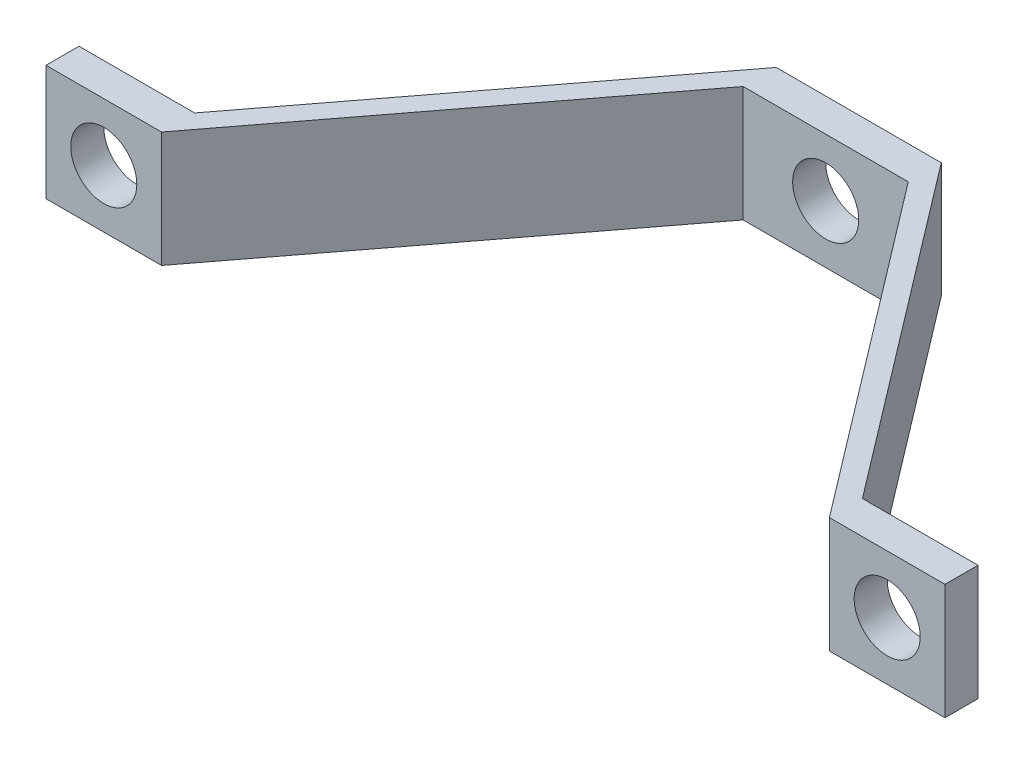
ISO-10303-21;
HEADER;
FILE_DESCRIPTION(('STEP AP214'),'2;1');
FILE_NAME('part.step','',(''),(''),'','','');
FILE_SCHEMA(('AUTOMOTIVE_DESIGN { 1 0 10303 214 1 1 1 1 }'));
ENDSEC;
DATA;
#1=APPLICATION_CONTEXT('core data for automotive mechanical design processes');
#2=APPLICATION_PROTOCOL_DEFINITION('international standard','automotive_design',2000,#1);
#3=PRODUCT_CONTEXT('',#1,'mechanical');
#4=PRODUCT('Part','Part','',(#3));
#5=PRODUCT_RELATED_PRODUCT_CATEGORY('part','',(#4));
#6=PRODUCT_DEFINITION_FORMATION('','',#4);
#7=PRODUCT_DEFINITION_CONTEXT('part definition',#1,'design');
#8=PRODUCT_DEFINITION('design','',#6,#7);
#9=PRODUCT_DEFINITION_SHAPE('','',#8);
#10=(LENGTH_UNIT() NAMED_UNIT(*) SI_UNIT(.MILLI.,.METRE.));
#11=(NAMED_UNIT(*) PLANE_ANGLE_UNIT() SI_UNIT($,.RADIAN.));
#12=(NAMED_UNIT(*) SI_UNIT($,.STERADIAN.) SOLID_ANGLE_UNIT());
#13=UNCERTAINTY_MEASURE_WITH_UNIT(LENGTH_MEASURE(1.E-05),#10,'distance_accuracy_value','');
#14=(GEOMETRIC_REPRESENTATION_CONTEXT(3) GLOBAL_UNCERTAINTY_ASSIGNED_CONTEXT((#13)) GLOBAL_UNIT_ASSIGNED_CONTEXT((#10,
#11,#12)) REPRESENTATION_CONTEXT('',''));
#15=CARTESIAN_POINT('',(0.,0.,0.));
#16=DIRECTION('',(0.,0.,1.));
#17=DIRECTION('',(1.,0.,0.));
#18=AXIS2_PLACEMENT_3D('',#15,#16,#17);
#19=CARTESIAN_POINT('',(34.57448,8.89,27.94));
#20=DIRECTION('',(0.,0.,-1.));
#21=DIRECTION('',(-1.,0.,0.));
#22=AXIS2_PLACEMENT_3D('',#19,#20,#21);
#23=PLANE('',#22);
#24=CARTESIAN_POINT('',(30.12948,4.445,27.94));
#25=DIRECTION('',(0.,0.,1.));
#26=DIRECTION('',(1.,0.,0.));
#27=AXIS2_PLACEMENT_3D('',#24,#25,#26);
#28=CIRCLE('',#27,2.54);
#29=CARTESIAN_POINT('',(32.66948,4.445,27.94));
#30=VERTEX_POINT('',#29);
#31=EDGE_CURVE('E265',#30,#30,#28,.T.);
#32=ORIENTED_EDGE('',*,*,#31,.F.);
#33=EDGE_LOOP('',(#32));
#34=FACE_BOUND('',#33,.T.);
#35=DIRECTION('',(1.,0.,0.));
#36=VECTOR('',#35,1.);
#37=CARTESIAN_POINT('',(34.57448,0.,27.94));
#38=LINE('',#37,#36);
#39=CARTESIAN_POINT('',(25.68448,0.,27.94));
#40=VERTEX_POINT('',#39);
#41=CARTESIAN_POINT('',(34.57448,0.,27.94));
#42=VERTEX_POINT('',#41);
#43=EDGE_CURVE('E155',#40,#42,#38,.T.);
#44=ORIENTED_EDGE('',*,*,#43,.T.);
#45=DIRECTION('',(0.,-1.,0.));
#46=VECTOR('',#45,1.);
#47=CARTESIAN_POINT('',(34.57448,8.89,27.94));
#48=LINE('',#47,#46);
#49=CARTESIAN_POINT('',(34.57448,8.89,27.94));
#50=VERTEX_POINT('',#49);
#51=EDGE_CURVE('E11',#50,#42,#48,.T.);
#52=ORIENTED_EDGE('',*,*,#51,.F.);
#53=DIRECTION('',(1.,0.,0.));
#54=VECTOR('',#53,1.);
#55=CARTESIAN_POINT('',(34.57448,8.89,27.94));
#56=LINE('',#55,#54);
#57=CARTESIAN_POINT('',(25.68448,8.89,27.94));
#58=VERTEX_POINT('',#57);
#59=EDGE_CURVE('E178',#58,#50,#56,.T.);
#60=ORIENTED_EDGE('',*,*,#59,.F.);
#61=DIRECTION('',(0.,-1.,0.));
#62=VECTOR('',#61,1.);
#63=CARTESIAN_POINT('',(25.68448,8.89,27.94));
#64=LINE('',#63,#62);
#65=EDGE_CURVE('E151',#58,#40,#64,.T.);
#66=ORIENTED_EDGE('',*,*,#65,.T.);
#67=EDGE_LOOP('',(#44,#52,#60,#66));
#68=FACE_BOUND('',#67,.T.);
#69=ADVANCED_FACE('F34',(#34,#68),#23,.F.);
#70=CARTESIAN_POINT('',(34.57448,8.89,25.4));
#71=DIRECTION('',(-1.,0.,0.));
#72=DIRECTION('',(0.,0.,1.));
#73=AXIS2_PLACEMENT_3D('',#70,#71,#72);
#74=PLANE('',#73);
#75=DIRECTION('',(0.,0.,-1.));
#76=VECTOR('',#75,1.);
#77=CARTESIAN_POINT('',(34.57448,0.,25.4));
#78=LINE('',#77,#76);
#79=CARTESIAN_POINT('',(34.57448,0.,25.4));
#80=VERTEX_POINT('',#79);
#81=EDGE_CURVE('E158',#42,#80,#78,.T.);
#82=ORIENTED_EDGE('',*,*,#81,.T.);
#83=DIRECTION('',(0.,-1.,0.));
#84=VECTOR('',#83,1.);
#85=CARTESIAN_POINT('',(34.57448,8.89,25.4));
#86=LINE('',#85,#84);
#87=CARTESIAN_POINT('',(34.57448,8.89,25.4));
#88=VERTEX_POINT('',#87);
#89=EDGE_CURVE('E43',#88,#80,#86,.T.);
#90=ORIENTED_EDGE('',*,*,#89,.F.);
#91=DIRECTION('',(0.,0.,-1.));
#92=VECTOR('',#91,1.);
#93=CARTESIAN_POINT('',(34.57448,8.89,25.4));
#94=LINE('',#93,#92);
#95=EDGE_CURVE('E106',#50,#88,#94,.T.);
#96=ORIENTED_EDGE('',*,*,#95,.F.);
#97=ORIENTED_EDGE('',*,*,#51,.T.);
#98=EDGE_LOOP('',(#82,#90,#96,#97));
#99=FACE_BOUND('',#98,.T.);
#100=ADVANCED_FACE('F258',(#99),#74,.F.);
#101=CARTESIAN_POINT('',(25.68448,8.89,25.4));
#102=DIRECTION('',(0.,0.,1.));
#103=DIRECTION('',(1.,0.,0.));
#104=AXIS2_PLACEMENT_3D('',#101,#102,#103);
#105=PLANE('',#104);
#106=CARTESIAN_POINT('',(30.12948,4.445,25.4));
#107=DIRECTION('',(0.,0.,1.));
#108=DIRECTION('',(1.,0.,0.));
#109=AXIS2_PLACEMENT_3D('',#106,#107,#108);
#110=CIRCLE('',#109,2.54);
#111=CARTESIAN_POINT('',(32.66948,4.445,25.4));
#112=VERTEX_POINT('',#111);
#113=EDGE_CURVE('E37',#112,#112,#110,.T.);
#114=ORIENTED_EDGE('',*,*,#113,.T.);
#115=EDGE_LOOP('',(#114));
#116=FACE_BOUND('',#115,.T.);
#117=DIRECTION('',(-1.,0.,0.));
#118=VECTOR('',#117,1.);
#119=CARTESIAN_POINT('',(25.68448,0.,25.4));
#120=LINE('',#119,#118);
#121=CARTESIAN_POINT('',(25.68448,0.,25.4));
#122=VERTEX_POINT('',#121);
#123=EDGE_CURVE('E161',#80,#122,#120,.T.);
#124=ORIENTED_EDGE('',*,*,#123,.T.);
#125=DIRECTION('',(0.,-1.,0.));
#126=VECTOR('',#125,1.);
#127=CARTESIAN_POINT('',(25.68448,8.89,25.4));
#128=LINE('',#127,#126);
#129=CARTESIAN_POINT('',(25.68448,8.89,25.4));
#130=VERTEX_POINT('',#129);
#131=EDGE_CURVE('E197',#130,#122,#128,.T.);
#132=ORIENTED_EDGE('',*,*,#131,.F.);
#133=DIRECTION('',(-1.,0.,0.));
#134=VECTOR('',#133,1.);
#135=CARTESIAN_POINT('',(25.68448,8.89,25.4));
#136=LINE('',#135,#134);
#137=EDGE_CURVE('E206',#88,#130,#136,.T.);
#138=ORIENTED_EDGE('',*,*,#137,.F.);
#139=ORIENTED_EDGE('',*,*,#89,.T.);
#140=EDGE_LOOP('',(#124,#132,#138,#139));
#141=FACE_BOUND('',#140,.T.);
#142=ADVANCED_FACE('F204',(#116,#141),#105,.F.);
#143=CARTESIAN_POINT('',(6.35,8.89,0.));
#144=DIRECTION('',(-0.795701974079693,0.,0.605688342669462));
#145=DIRECTION('',(0.605688342669462,0.,0.795701974079693));
#146=AXIS2_PLACEMENT_3D('',#143,#144,#145);
#147=PLANE('',#146);
#148=DIRECTION('',(-0.605688342669462,0.,-0.795701974079693));
#149=VECTOR('',#148,1.);
#150=CARTESIAN_POINT('',(6.35,0.,0.));
#151=LINE('',#150,#149);
#152=CARTESIAN_POINT('',(6.35,0.,0.));
#153=VERTEX_POINT('',#152);
#154=EDGE_CURVE('E163',#122,#153,#151,.T.);
#155=ORIENTED_EDGE('',*,*,#154,.T.);
#156=DIRECTION('',(0.,-1.,0.));
#157=VECTOR('',#156,1.);
#158=CARTESIAN_POINT('',(6.35,8.89,0.));
#159=LINE('',#158,#157);
#160=CARTESIAN_POINT('',(6.35,8.89,0.));
#161=VERTEX_POINT('',#160);
#162=EDGE_CURVE('E194',#161,#153,#159,.T.);
#163=ORIENTED_EDGE('',*,*,#162,.F.);
#164=DIRECTION('',(-0.605688342669462,0.,-0.795701974079693));
#165=VECTOR('',#164,1.);
#166=CARTESIAN_POINT('',(6.35,8.89,0.));
#167=LINE('',#166,#165);
#168=EDGE_CURVE('E224',#130,#161,#167,.T.);
#169=ORIENTED_EDGE('',*,*,#168,.F.);
#170=ORIENTED_EDGE('',*,*,#131,.T.);
#171=EDGE_LOOP('',(#155,#163,#169,#170));
#172=FACE_BOUND('',#171,.T.);
#173=ADVANCED_FACE('F215',(#172),#147,.F.);
#174=CARTESIAN_POINT('',(6.35,8.89,0.));
#175=DIRECTION('',(0.,0.,1.));
#176=DIRECTION('',(1.,0.,0.));
#177=AXIS2_PLACEMENT_3D('',#174,#175,#176);
#178=PLANE('',#177);
#179=CARTESIAN_POINT('',(0.,4.445,0.));
#180=DIRECTION('',(0.,0.,1.));
#181=DIRECTION('',(1.,0.,0.));
#182=AXIS2_PLACEMENT_3D('',#179,#180,#181);
#183=CIRCLE('',#182,2.54);
#184=CARTESIAN_POINT('',(2.54,4.445,0.));
#185=VERTEX_POINT('',#184);
#186=EDGE_CURVE('E267',#185,#185,#183,.T.);
#187=ORIENTED_EDGE('',*,*,#186,.T.);
#188=EDGE_LOOP('',(#187));
#189=FACE_BOUND('',#188,.T.);
#190=DIRECTION('',(-1.,0.,0.));
#191=VECTOR('',#190,1.);
#192=CARTESIAN_POINT('',(6.35,0.,0.));
#193=LINE('',#192,#191);
#194=CARTESIAN_POINT('',(-6.35,0.,0.));
#195=VERTEX_POINT('',#194);
#196=EDGE_CURVE('E165',#153,#195,#193,.T.);
#197=ORIENTED_EDGE('',*,*,#196,.T.);
#198=DIRECTION('',(0.,-1.,0.));
#199=VECTOR('',#198,1.);
#200=CARTESIAN_POINT('',(-6.35,8.89,0.));
#201=LINE('',#200,#199);
#202=CARTESIAN_POINT('',(-6.35,8.89,0.));
#203=VERTEX_POINT('',#202);
#204=EDGE_CURVE('E191',#203,#195,#201,.T.);
#205=ORIENTED_EDGE('',*,*,#204,.F.);
#206=DIRECTION('',(-1.,0.,0.));
#207=VECTOR('',#206,1.);
#208=CARTESIAN_POINT('',(6.35,8.89,0.));
#209=LINE('',#208,#207);
#210=EDGE_CURVE('E221',#161,#203,#209,.T.);
#211=ORIENTED_EDGE('',*,*,#210,.F.);
#212=ORIENTED_EDGE('',*,*,#162,.T.);
#213=EDGE_LOOP('',(#197,#205,#211,#212));
#214=FACE_BOUND('',#213,.T.);
#215=ADVANCED_FACE('F219',(#189,#214),#178,.F.);
#216=CARTESIAN_POINT('',(-6.35,8.89,0.));
#217=DIRECTION('',(0.795701974079693,0.,0.605688342669462));
#218=DIRECTION('',(0.605688342669462,0.,-0.795701974079693));
#219=AXIS2_PLACEMENT_3D('',#216,#217,#218);
#220=PLANE('',#219);
#221=DIRECTION('',(-0.605688342669462,0.,0.795701974079693));
#222=VECTOR('',#221,1.);
#223=CARTESIAN_POINT('',(-6.35,0.,0.));
#224=LINE('',#223,#222);
#225=CARTESIAN_POINT('',(-25.68448,0.,25.4));
#226=VERTEX_POINT('',#225);
#227=EDGE_CURVE('E167',#195,#226,#224,.T.);
#228=ORIENTED_EDGE('',*,*,#227,.T.);
#229=DIRECTION('',(0.,-1.,0.));
#230=VECTOR('',#229,1.);
#231=CARTESIAN_POINT('',(-25.68448,8.89,25.4));
#232=LINE('',#231,#230);
#233=CARTESIAN_POINT('',(-25.68448,8.89,25.4));
#234=VERTEX_POINT('',#233);
#235=EDGE_CURVE('E188',#234,#226,#232,.T.);
#236=ORIENTED_EDGE('',*,*,#235,.F.);
#237=DIRECTION('',(-0.605688342669462,0.,0.795701974079693));
#238=VECTOR('',#237,1.);
#239=CARTESIAN_POINT('',(-6.35,8.89,0.));
#240=LINE('',#239,#238);
#241=EDGE_CURVE('E223',#203,#234,#240,.T.);
#242=ORIENTED_EDGE('',*,*,#241,.F.);
#243=ORIENTED_EDGE('',*,*,#204,.T.);
#244=EDGE_LOOP('',(#228,#236,#242,#243));
#245=FACE_BOUND('',#244,.T.);
#246=ADVANCED_FACE('F308',(#245),#220,.F.);
#247=CARTESIAN_POINT('',(-25.68448,8.89,25.4));
#248=DIRECTION('',(0.,0.,1.));
#249=DIRECTION('',(1.,0.,0.));
#250=AXIS2_PLACEMENT_3D('',#247,#248,#249);
#251=PLANE('',#250);
#252=CARTESIAN_POINT('',(-30.12948,4.445,25.4));
#253=DIRECTION('',(0.,0.,1.));
#254=DIRECTION('',(1.,0.,0.));
#255=AXIS2_PLACEMENT_3D('',#252,#253,#254);
#256=CIRCLE('',#255,2.54);
#257=CARTESIAN_POINT('',(-27.58948,4.445,25.4));
#258=VERTEX_POINT('',#257);
#259=EDGE_CURVE('E159',#258,#258,#256,.T.);
#260=ORIENTED_EDGE('',*,*,#259,.T.);
#261=EDGE_LOOP('',(#260));
#262=FACE_BOUND('',#261,.T.);
#263=DIRECTION('',(-1.,0.,0.));
#264=VECTOR('',#263,1.);
#265=CARTESIAN_POINT('',(-25.68448,0.,25.4));
#266=LINE('',#265,#264);
#267=CARTESIAN_POINT('',(-34.57448,0.,25.4));
#268=VERTEX_POINT('',#267);
#269=EDGE_CURVE('E169',#226,#268,#266,.T.);
#270=ORIENTED_EDGE('',*,*,#269,.T.);
#271=DIRECTION('',(0.,-1.,0.));
#272=VECTOR('',#271,1.);
#273=CARTESIAN_POINT('',(-34.57448,8.89,25.4));
#274=LINE('',#273,#272);
#275=CARTESIAN_POINT('',(-34.57448,8.89,25.4));
#276=VERTEX_POINT('',#275);
#277=EDGE_CURVE('E185',#276,#268,#274,.T.);
#278=ORIENTED_EDGE('',*,*,#277,.F.);
#279=DIRECTION('',(-1.,0.,0.));
#280=VECTOR('',#279,1.);
#281=CARTESIAN_POINT('',(-25.68448,8.89,25.4));
#282=LINE('',#281,#280);
#283=EDGE_CURVE('E226',#234,#276,#282,.T.);
#284=ORIENTED_EDGE('',*,*,#283,.F.);
#285=ORIENTED_EDGE('',*,*,#235,.T.);
#286=EDGE_LOOP('',(#270,#278,#284,#285));
#287=FACE_BOUND('',#286,.T.);
#288=ADVANCED_FACE('F283',(#262,#287),#251,.F.);
#289=CARTESIAN_POINT('',(-34.57448,8.89,25.4));
#290=DIRECTION('',(1.,0.,0.));
#291=DIRECTION('',(0.,0.,-1.));
#292=AXIS2_PLACEMENT_3D('',#289,#290,#291);
#293=PLANE('',#292);
#294=DIRECTION('',(0.,0.,1.));
#295=VECTOR('',#294,1.);
#296=CARTESIAN_POINT('',(-34.57448,0.,25.4));
#297=LINE('',#296,#295);
#298=CARTESIAN_POINT('',(-34.57448,0.,27.94));
#299=VERTEX_POINT('',#298);
#300=EDGE_CURVE('E171',#268,#299,#297,.T.);
#301=ORIENTED_EDGE('',*,*,#300,.T.);
#302=DIRECTION('',(0.,-1.,0.));
#303=VECTOR('',#302,1.);
#304=CARTESIAN_POINT('',(-34.57448,8.89,27.94));
#305=LINE('',#304,#303);
#306=CARTESIAN_POINT('',(-34.57448,8.89,27.94));
#307=VERTEX_POINT('',#306);
#308=EDGE_CURVE('E182',#307,#299,#305,.T.);
#309=ORIENTED_EDGE('',*,*,#308,.F.);
#310=DIRECTION('',(0.,0.,1.));
#311=VECTOR('',#310,1.);
#312=CARTESIAN_POINT('',(-34.57448,8.89,25.4));
#313=LINE('',#312,#311);
#314=EDGE_CURVE('E232',#276,#307,#313,.T.);
#315=ORIENTED_EDGE('',*,*,#314,.F.);
#316=ORIENTED_EDGE('',*,*,#277,.T.);
#317=EDGE_LOOP('',(#301,#309,#315,#316));
#318=FACE_BOUND('',#317,.T.);
#319=ADVANCED_FACE('F238',(#318),#293,.F.);
#320=CARTESIAN_POINT('',(-34.57448,8.89,27.94));
#321=DIRECTION('',(0.,0.,-1.));
#322=DIRECTION('',(-1.,0.,0.));
#323=AXIS2_PLACEMENT_3D('',#320,#321,#322);
#324=PLANE('',#323);
#325=CARTESIAN_POINT('',(-30.12948,4.445,27.94));
#326=DIRECTION('',(0.,0.,1.));
#327=DIRECTION('',(1.,0.,0.));
#328=AXIS2_PLACEMENT_3D('',#325,#326,#327);
#329=CIRCLE('',#328,2.54);
#330=CARTESIAN_POINT('',(-27.58948,4.445,27.94));
#331=VERTEX_POINT('',#330);
#332=EDGE_CURVE('E270',#331,#331,#329,.T.);
#333=ORIENTED_EDGE('',*,*,#332,.F.);
#334=EDGE_LOOP('',(#333));
#335=FACE_BOUND('',#334,.T.);
#336=DIRECTION('',(1.,0.,0.));
#337=VECTOR('',#336,1.);
#338=CARTESIAN_POINT('',(-34.57448,0.,27.94));
#339=LINE('',#338,#337);
#340=CARTESIAN_POINT('',(-25.68448,0.,27.94));
#341=VERTEX_POINT('',#340);
#342=EDGE_CURVE('E173',#299,#341,#339,.T.);
#343=ORIENTED_EDGE('',*,*,#342,.T.);
#344=DIRECTION('',(0.,-1.,0.));
#345=VECTOR('',#344,1.);
#346=CARTESIAN_POINT('',(-25.68448,8.89,27.94));
#347=LINE('',#346,#345);
#348=CARTESIAN_POINT('',(-25.68448,8.89,27.94));
#349=VERTEX_POINT('',#348);
#350=EDGE_CURVE('E146',#349,#341,#347,.T.);
#351=ORIENTED_EDGE('',*,*,#350,.F.);
#352=DIRECTION('',(1.,0.,0.));
#353=VECTOR('',#352,1.);
#354=CARTESIAN_POINT('',(-34.57448,8.89,27.94));
#355=LINE('',#354,#353);
#356=EDGE_CURVE('E137',#307,#349,#355,.T.);
#357=ORIENTED_EDGE('',*,*,#356,.F.);
#358=ORIENTED_EDGE('',*,*,#308,.T.);
#359=EDGE_LOOP('',(#343,#351,#357,#358));
#360=FACE_BOUND('',#359,.T.);
#361=ADVANCED_FACE('F242',(#335,#360),#324,.F.);
#362=CARTESIAN_POINT('',(-25.68448,8.89,27.94));
#363=DIRECTION('',(-0.795701974079693,0.,-0.605688342669462));
#364=DIRECTION('',(-0.605688342669462,0.,0.795701974079693));
#365=AXIS2_PLACEMENT_3D('',#362,#363,#364);
#366=PLANE('',#365);
#367=DIRECTION('',(0.605688342669462,0.,-0.795701974079693));
#368=VECTOR('',#367,1.);
#369=CARTESIAN_POINT('',(-25.68448,0.,27.94));
#370=LINE('',#369,#368);
#371=CARTESIAN_POINT('',(-6.35,0.,2.54));
#372=VERTEX_POINT('',#371);
#373=EDGE_CURVE('E145',#341,#372,#370,.T.);
#374=ORIENTED_EDGE('',*,*,#373,.T.);
#375=DIRECTION('',(0.,-1.,0.));
#376=VECTOR('',#375,1.);
#377=CARTESIAN_POINT('',(-6.35,8.89,2.54));
#378=LINE('',#377,#376);
#379=CARTESIAN_POINT('',(-6.35,8.89,2.54));
#380=VERTEX_POINT('',#379);
#381=EDGE_CURVE('E142',#380,#372,#378,.T.);
#382=ORIENTED_EDGE('',*,*,#381,.F.);
#383=DIRECTION('',(0.605688342669462,0.,-0.795701974079693));
#384=VECTOR('',#383,1.);
#385=CARTESIAN_POINT('',(-25.68448,8.89,27.94));
#386=LINE('',#385,#384);
#387=EDGE_CURVE('E131',#349,#380,#386,.T.);
#388=ORIENTED_EDGE('',*,*,#387,.F.);
#389=ORIENTED_EDGE('',*,*,#350,.T.);
#390=EDGE_LOOP('',(#374,#382,#388,#389));
#391=FACE_BOUND('',#390,.T.);
#392=ADVANCED_FACE('F143',(#391),#366,.F.);
#393=CARTESIAN_POINT('',(-6.35,8.89,2.54));
#394=DIRECTION('',(0.,0.,-1.));
#395=DIRECTION('',(-1.,0.,0.));
#396=AXIS2_PLACEMENT_3D('',#393,#394,#395);
#397=PLANE('',#396);
#398=CARTESIAN_POINT('',(0.,4.445,2.54));
#399=DIRECTION('',(0.,0.,1.));
#400=DIRECTION('',(1.,0.,0.));
#401=AXIS2_PLACEMENT_3D('',#398,#399,#400);
#402=CIRCLE('',#401,2.54);
#403=CARTESIAN_POINT('',(2.54,4.445,2.54));
#404=VERTEX_POINT('',#403);
#405=EDGE_CURVE('E272',#404,#404,#402,.T.);
#406=ORIENTED_EDGE('',*,*,#405,.F.);
#407=EDGE_LOOP('',(#406));
#408=FACE_BOUND('',#407,.T.);
#409=DIRECTION('',(1.,0.,0.));
#410=VECTOR('',#409,1.);
#411=CARTESIAN_POINT('',(-6.35,0.,2.54));
#412=LINE('',#411,#410);
#413=CARTESIAN_POINT('',(6.35,0.,2.54));
#414=VERTEX_POINT('',#413);
#415=EDGE_CURVE('E92',#372,#414,#412,.T.);
#416=ORIENTED_EDGE('',*,*,#415,.T.);
#417=DIRECTION('',(0.,-1.,0.));
#418=VECTOR('',#417,1.);
#419=CARTESIAN_POINT('',(6.35,8.89,2.54));
#420=LINE('',#419,#418);
#421=CARTESIAN_POINT('',(6.35,8.89,2.54));
#422=VERTEX_POINT('',#421);
#423=EDGE_CURVE('E147',#422,#414,#420,.T.);
#424=ORIENTED_EDGE('',*,*,#423,.F.);
#425=DIRECTION('',(1.,0.,0.));
#426=VECTOR('',#425,1.);
#427=CARTESIAN_POINT('',(-6.35,8.89,2.54));
#428=LINE('',#427,#426);
#429=EDGE_CURVE('E135',#380,#422,#428,.T.);
#430=ORIENTED_EDGE('',*,*,#429,.F.);
#431=ORIENTED_EDGE('',*,*,#381,.T.);
#432=EDGE_LOOP('',(#416,#424,#430,#431));
#433=FACE_BOUND('',#432,.T.);
#434=ADVANCED_FACE('F149',(#408,#433),#397,.F.);
#435=CARTESIAN_POINT('',(25.68448,8.89,27.94));
#436=DIRECTION('',(0.795701974079693,0.,-0.605688342669462));
#437=DIRECTION('',(-0.605688342669462,0.,-0.795701974079693));
#438=AXIS2_PLACEMENT_3D('',#435,#436,#437);
#439=PLANE('',#438);
#440=DIRECTION('',(0.605688342669462,0.,0.795701974079693));
#441=VECTOR('',#440,1.);
#442=CARTESIAN_POINT('',(25.68448,0.,27.94));
#443=LINE('',#442,#441);
#444=EDGE_CURVE('E98',#414,#40,#443,.T.);
#445=ORIENTED_EDGE('',*,*,#444,.T.);
#446=ORIENTED_EDGE('',*,*,#65,.F.);
#447=DIRECTION('',(0.605688342669462,0.,0.795701974079693));
#448=VECTOR('',#447,1.);
#449=CARTESIAN_POINT('',(25.68448,8.89,27.94));
#450=LINE('',#449,#448);
#451=EDGE_CURVE('E51',#422,#58,#450,.T.);
#452=ORIENTED_EDGE('',*,*,#451,.F.);
#453=ORIENTED_EDGE('',*,*,#423,.T.);
#454=EDGE_LOOP('',(#445,#446,#452,#453));
#455=FACE_BOUND('',#454,.T.);
#456=ADVANCED_FACE('F246',(#455),#439,.F.);
#457=CARTESIAN_POINT('',(0.,8.89,0.));
#458=DIRECTION('',(0.,1.,0.));
#459=DIRECTION('',(0.,0.,1.));
#460=AXIS2_PLACEMENT_3D('',#457,#458,#459);
#461=PLANE('',#460);
#462=ORIENTED_EDGE('',*,*,#59,.T.);
#463=ORIENTED_EDGE('',*,*,#95,.T.);
#464=ORIENTED_EDGE('',*,*,#137,.T.);
#465=ORIENTED_EDGE('',*,*,#168,.T.);
#466=ORIENTED_EDGE('',*,*,#210,.T.);
#467=ORIENTED_EDGE('',*,*,#241,.T.);
#468=ORIENTED_EDGE('',*,*,#283,.T.);
#469=ORIENTED_EDGE('',*,*,#314,.T.);
#470=ORIENTED_EDGE('',*,*,#356,.T.);
#471=ORIENTED_EDGE('',*,*,#387,.T.);
#472=ORIENTED_EDGE('',*,*,#429,.T.);
#473=ORIENTED_EDGE('',*,*,#451,.T.);
#474=EDGE_LOOP('',(#462,#463,#464,#465,#466,#467,#468,#469,#470,#471,#472,#473));
#475=FACE_BOUND('',#474,.T.);
#476=ADVANCED_FACE('F133',(#475),#461,.T.);
#477=CARTESIAN_POINT('',(0.,0.,0.));
#478=DIRECTION('',(0.,1.,0.));
#479=DIRECTION('',(0.,0.,1.));
#480=AXIS2_PLACEMENT_3D('',#477,#478,#479);
#481=PLANE('',#480);
#482=ORIENTED_EDGE('',*,*,#43,.F.);
#483=ORIENTED_EDGE('',*,*,#444,.F.);
#484=ORIENTED_EDGE('',*,*,#415,.F.);
#485=ORIENTED_EDGE('',*,*,#373,.F.);
#486=ORIENTED_EDGE('',*,*,#342,.F.);
#487=ORIENTED_EDGE('',*,*,#300,.F.);
#488=ORIENTED_EDGE('',*,*,#269,.F.);
#489=ORIENTED_EDGE('',*,*,#227,.F.);
#490=ORIENTED_EDGE('',*,*,#196,.F.);
#491=ORIENTED_EDGE('',*,*,#154,.F.);
#492=ORIENTED_EDGE('',*,*,#123,.F.);
#493=ORIENTED_EDGE('',*,*,#81,.F.);
#494=EDGE_LOOP('',(#482,#483,#484,#485,#486,#487,#488,#489,#490,#491,#492,#493));
#495=FACE_BOUND('',#494,.T.);
#496=ADVANCED_FACE('F210',(#495),#481,.F.);
#497=CARTESIAN_POINT('',(-30.12948,4.445,0.));
#498=DIRECTION('',(0.,0.,1.));
#499=DIRECTION('',(1.,0.,0.));
#500=AXIS2_PLACEMENT_3D('',#497,#498,#499);
#501=CYLINDRICAL_SURFACE('',#500,2.54);
#502=ORIENTED_EDGE('',*,*,#332,.T.);
#503=EDGE_LOOP('',(#502));
#504=FACE_BOUND('',#503,.T.);
#505=ORIENTED_EDGE('',*,*,#259,.F.);
#506=EDGE_LOOP('',(#505));
#507=FACE_BOUND('',#506,.T.);
#508=ADVANCED_FACE('F286',(#504,#507),#501,.F.);
#509=CARTESIAN_POINT('',(30.12948,4.445,0.));
#510=DIRECTION('',(0.,0.,1.));
#511=DIRECTION('',(1.,0.,0.));
#512=AXIS2_PLACEMENT_3D('',#509,#510,#511);
#513=CYLINDRICAL_SURFACE('',#512,2.54);
#514=ORIENTED_EDGE('',*,*,#31,.T.);
#515=EDGE_LOOP('',(#514));
#516=FACE_BOUND('',#515,.T.);
#517=ORIENTED_EDGE('',*,*,#113,.F.);
#518=EDGE_LOOP('',(#517));
#519=FACE_BOUND('',#518,.T.);
#520=ADVANCED_FACE('F288',(#516,#519),#513,.F.);
#521=CARTESIAN_POINT('',(0.,4.445,-6.35));
#522=DIRECTION('',(0.,0.,1.));
#523=DIRECTION('',(1.,0.,0.));
#524=AXIS2_PLACEMENT_3D('',#521,#522,#523);
#525=CYLINDRICAL_SURFACE('',#524,2.54);
#526=ORIENTED_EDGE('',*,*,#405,.T.);
#527=EDGE_LOOP('',(#526));
#528=FACE_BOUND('',#527,.T.);
#529=ORIENTED_EDGE('',*,*,#186,.F.);
#530=EDGE_LOOP('',(#529));
#531=FACE_BOUND('',#530,.T.);
#532=ADVANCED_FACE('F295',(#528,#531),#525,.F.);
#533=CLOSED_SHELL('',(#69,#100,#142,#173,#215,#246,#288,#319,#361,#392,#434,#456,#476,#496,#508,
#520,#532));
#534=MANIFOLD_SOLID_BREP('B2',#533);
#535=ADVANCED_BREP_SHAPE_REPRESENTATION('',(#18,#534),#14);
#536=SHAPE_DEFINITION_REPRESENTATION(#9,#535);
ENDSEC;
END-ISO-10303-21;
